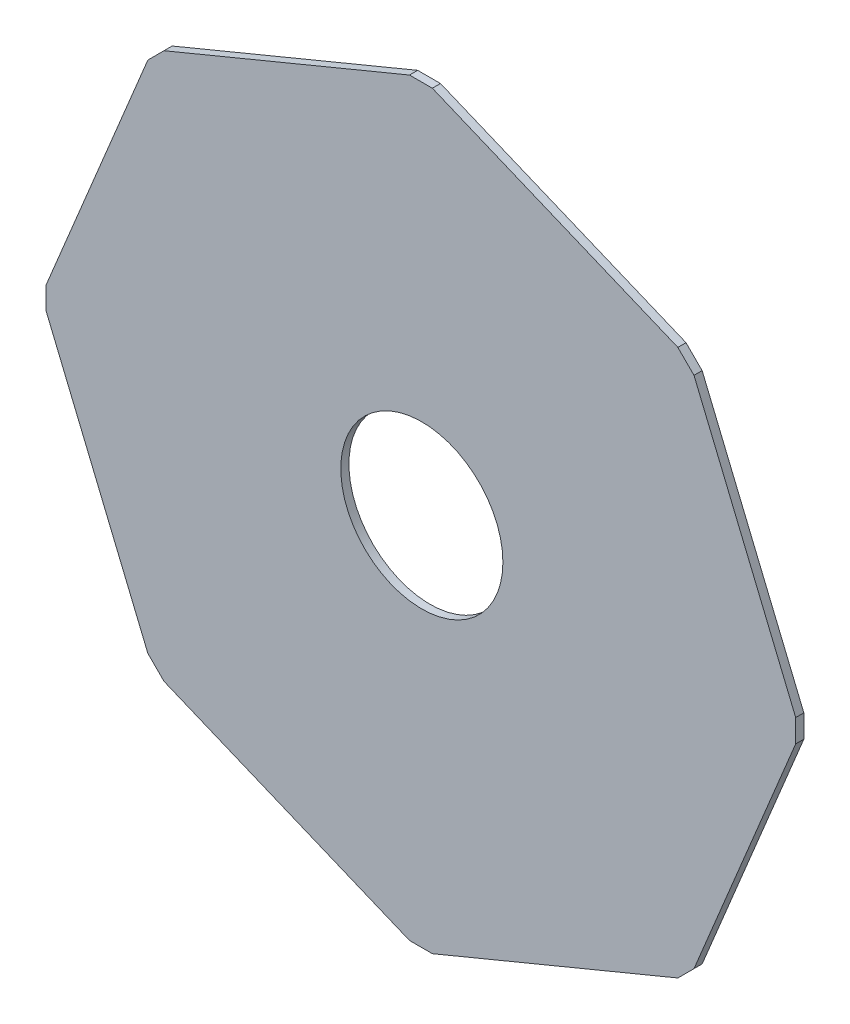
ISO-10303-21;
HEADER;
FILE_DESCRIPTION(('STEP AP214'),'2;1');
FILE_NAME('part.step','',(''),(''),'','','');
FILE_SCHEMA(('AUTOMOTIVE_DESIGN { 1 0 10303 214 1 1 1 1 }'));
ENDSEC;
DATA;
#1=APPLICATION_CONTEXT('core data for automotive mechanical design processes');
#2=APPLICATION_PROTOCOL_DEFINITION('international standard','automotive_design',2000,#1);
#3=PRODUCT_CONTEXT('',#1,'mechanical');
#4=PRODUCT('Part','Part','',(#3));
#5=PRODUCT_RELATED_PRODUCT_CATEGORY('part','',(#4));
#6=PRODUCT_DEFINITION_FORMATION('','',#4);
#7=PRODUCT_DEFINITION_CONTEXT('part definition',#1,'design');
#8=PRODUCT_DEFINITION('design','',#6,#7);
#9=PRODUCT_DEFINITION_SHAPE('','',#8);
#10=(LENGTH_UNIT() NAMED_UNIT(*) SI_UNIT(.MILLI.,.METRE.));
#11=(NAMED_UNIT(*) PLANE_ANGLE_UNIT() SI_UNIT($,.RADIAN.));
#12=(NAMED_UNIT(*) SI_UNIT($,.STERADIAN.) SOLID_ANGLE_UNIT());
#13=UNCERTAINTY_MEASURE_WITH_UNIT(LENGTH_MEASURE(1.E-05),#10,'distance_accuracy_value','');
#14=(GEOMETRIC_REPRESENTATION_CONTEXT(3) GLOBAL_UNCERTAINTY_ASSIGNED_CONTEXT((#13)) GLOBAL_UNIT_ASSIGNED_CONTEXT((#10,
#11,#12)) REPRESENTATION_CONTEXT('',''));
#15=CARTESIAN_POINT('',(0.,0.,0.));
#16=DIRECTION('',(0.,0.,1.));
#17=DIRECTION('',(1.,0.,0.));
#18=AXIS2_PLACEMENT_3D('',#15,#16,#17);
#19=CARTESIAN_POINT('',(0.,0.,5.));
#20=DIRECTION('',(0.,0.,1.));
#21=DIRECTION('',(1.,0.,0.));
#22=AXIS2_PLACEMENT_3D('',#19,#20,#21);
#23=PLANE('',#22);
#24=DIRECTION('',(0.,-1.,0.));
#25=VECTOR('',#24,1.);
#26=CARTESIAN_POINT('',(-230.557942617036,7.27897130849087,5.));
#27=LINE('',#26,#25);
#28=CARTESIAN_POINT('',(-230.557942617036,7.27897130849087,5.));
#29=VERTEX_POINT('',#28);
#30=CARTESIAN_POINT('',(-230.557942617036,-6.7210286914996,5.));
#31=VERTEX_POINT('',#30);
#32=EDGE_CURVE('E211',#29,#31,#27,.T.);
#33=ORIENTED_EDGE('',*,*,#32,.T.);
#34=DIRECTION('',(0.382683432365128,-0.923879532511271,0.));
#35=VECTOR('',#34,1.);
#36=CARTESIAN_POINT('',(-230.557942617036,-6.7210286914996,5.));
#37=LINE('',#36,#35);
#38=CARTESIAN_POINT('',(-168.142249758237,-157.405840896109,5.));
#39=VERTEX_POINT('',#38);
#40=EDGE_CURVE('E119',#31,#39,#37,.T.);
#41=ORIENTED_EDGE('',*,*,#40,.T.);
#42=DIRECTION('',(0.707106781186801,-0.707106781186294,0.));
#43=VECTOR('',#42,1.);
#44=CARTESIAN_POINT('',(-168.142249758237,-157.405840896109,5.));
#45=LINE('',#44,#43);
#46=CARTESIAN_POINT('',(-158.242754821622,-167.305335832717,5.));
#47=VERTEX_POINT('',#46);
#48=EDGE_CURVE('E250',#39,#47,#45,.T.);
#49=ORIENTED_EDGE('',*,*,#48,.T.);
#50=DIRECTION('',(0.923879532511295,-0.382683432365069,0.));
#51=VECTOR('',#50,1.);
#52=CARTESIAN_POINT('',(-158.242754821622,-167.305335832717,5.));
#53=LINE('',#52,#51);
#54=CARTESIAN_POINT('',(-7.55794261702294,-229.721028691501,5.));
#55=VERTEX_POINT('',#54);
#56=EDGE_CURVE('E269',#47,#55,#53,.T.);
#57=ORIENTED_EDGE('',*,*,#56,.T.);
#58=DIRECTION('',(1.,0.,0.));
#59=VECTOR('',#58,1.);
#60=CARTESIAN_POINT('',(-7.55794261702294,-229.721028691501,5.));
#61=LINE('',#60,#59);
#62=CARTESIAN_POINT('',(6.4420573829764,-229.721028691501,5.));
#63=VERTEX_POINT('',#62);
#64=EDGE_CURVE('E266',#55,#63,#61,.T.);
#65=ORIENTED_EDGE('',*,*,#64,.T.);
#66=DIRECTION('',(0.923879532511268,0.382683432365135,0.));
#67=VECTOR('',#66,1.);
#68=CARTESIAN_POINT('',(6.4420573829764,-229.721028691501,5.));
#69=LINE('',#68,#67);
#70=CARTESIAN_POINT('',(157.126869587579,-167.305335832703,5.));
#71=VERTEX_POINT('',#70);
#72=EDGE_CURVE('E268',#63,#71,#69,.T.);
#73=ORIENTED_EDGE('',*,*,#72,.T.);
#74=DIRECTION('',(0.707106781186548,0.707106781186548,0.));
#75=VECTOR('',#74,1.);
#76=CARTESIAN_POINT('',(157.126869587579,-167.305335832703,5.));
#77=LINE('',#76,#75);
#78=CARTESIAN_POINT('',(167.026364524185,-157.405840896097,5.));
#79=VERTEX_POINT('',#78);
#80=EDGE_CURVE('E271',#71,#79,#77,.T.);
#81=ORIENTED_EDGE('',*,*,#80,.T.);
#82=DIRECTION('',(0.382683432365019,0.923879532511316,0.));
#83=VECTOR('',#82,1.);
#84=CARTESIAN_POINT('',(167.026364524185,-157.405840896097,5.));
#85=LINE('',#84,#83);
#86=CARTESIAN_POINT('',(229.442057382966,-6.72102869148158,5.));
#87=VERTEX_POINT('',#86);
#88=EDGE_CURVE('E277',#79,#87,#85,.T.);
#89=ORIENTED_EDGE('',*,*,#88,.T.);
#90=DIRECTION('',(0.,1.,0.));
#91=VECTOR('',#90,1.);
#92=CARTESIAN_POINT('',(229.442057382966,-6.72102869148158,5.));
#93=LINE('',#92,#91);
#94=CARTESIAN_POINT('',(229.442057382966,7.27897130850405,5.));
#95=VERTEX_POINT('',#94);
#96=EDGE_CURVE('E279',#87,#95,#93,.T.);
#97=ORIENTED_EDGE('',*,*,#96,.T.);
#98=DIRECTION('',(-0.38268343236497,0.923879532511336,0.));
#99=VECTOR('',#98,1.);
#100=CARTESIAN_POINT('',(229.442057382966,7.27897130850405,5.));
#101=LINE('',#100,#99);
#102=CARTESIAN_POINT('',(167.026364524201,157.963783513104,5.));
#103=VERTEX_POINT('',#102);
#104=EDGE_CURVE('E281',#95,#103,#101,.T.);
#105=ORIENTED_EDGE('',*,*,#104,.T.);
#106=DIRECTION('',(-0.707106781186548,0.707106781186548,0.));
#107=VECTOR('',#106,1.);
#108=CARTESIAN_POINT('',(167.026364524201,157.963783513104,5.));
#109=LINE('',#108,#107);
#110=CARTESIAN_POINT('',(157.126869587596,167.863278449709,5.));
#111=VERTEX_POINT('',#110);
#112=EDGE_CURVE('E283',#103,#111,#109,.T.);
#113=ORIENTED_EDGE('',*,*,#112,.T.);
#114=DIRECTION('',(-0.923879532511311,0.38268343236503,0.));
#115=VECTOR('',#114,1.);
#116=CARTESIAN_POINT('',(157.126869587596,167.863278449709,5.));
#117=LINE('',#116,#115);
#118=CARTESIAN_POINT('',(6.44205738297554,230.278971308494,5.));
#119=VERTEX_POINT('',#118);
#120=EDGE_CURVE('E285',#111,#119,#117,.T.);
#121=ORIENTED_EDGE('',*,*,#120,.T.);
#122=DIRECTION('',(-1.,0.,0.));
#123=VECTOR('',#122,1.);
#124=CARTESIAN_POINT('',(6.44205738297554,230.278971308494,5.));
#125=LINE('',#124,#123);
#126=CARTESIAN_POINT('',(-7.55794261702026,230.278971308494,5.));
#127=VERTEX_POINT('',#126);
#128=EDGE_CURVE('E162',#119,#127,#125,.T.);
#129=ORIENTED_EDGE('',*,*,#128,.T.);
#130=DIRECTION('',(-0.923879532511271,-0.382683432365128,0.));
#131=VECTOR('',#130,1.);
#132=CARTESIAN_POINT('',(-7.55794261702026,230.278971308494,5.));
#133=LINE('',#132,#131);
#134=CARTESIAN_POINT('',(-158.24275482163,167.863278449695,5.));
#135=VERTEX_POINT('',#134);
#136=EDGE_CURVE('E156',#127,#135,#133,.T.);
#137=ORIENTED_EDGE('',*,*,#136,.T.);
#138=DIRECTION('',(-0.707106781186548,-0.707106781186548,0.));
#139=VECTOR('',#138,1.);
#140=CARTESIAN_POINT('',(-158.24275482163,167.863278449695,5.));
#141=LINE('',#140,#139);
#142=CARTESIAN_POINT('',(-168.142249758279,157.963783513045,5.));
#143=VERTEX_POINT('',#142);
#144=EDGE_CURVE('E160',#135,#143,#141,.T.);
#145=ORIENTED_EDGE('',*,*,#144,.T.);
#146=DIRECTION('',(-0.382683432365024,-0.923879532511314,0.));
#147=VECTOR('',#146,1.);
#148=CARTESIAN_POINT('',(-168.142249758279,157.963783513045,5.));
#149=LINE('',#148,#147);
#150=EDGE_CURVE('E52',#143,#29,#149,.T.);
#151=ORIENTED_EDGE('',*,*,#150,.T.);
#152=EDGE_LOOP('',(#33,#41,#49,#57,#65,#73,#81,#89,#97,#105,#113,#121,#129,#137,#145,#151));
#153=FACE_BOUND('',#152,.T.);
#154=CARTESIAN_POINT('',(0.,0.,5.));
#155=DIRECTION('',(0.,0.,1.));
#156=DIRECTION('',(1.,0.,0.));
#157=AXIS2_PLACEMENT_3D('',#154,#155,#156);
#158=CIRCLE('',#157,49.75);
#159=CARTESIAN_POINT('',(49.75,0.,5.));
#160=VERTEX_POINT('',#159);
#161=EDGE_CURVE('E184',#160,#160,#158,.T.);
#162=ORIENTED_EDGE('',*,*,#161,.F.);
#163=EDGE_LOOP('',(#162));
#164=FACE_BOUND('',#163,.T.);
#165=ADVANCED_FACE('F35',(#153,#164),#23,.T.);
#166=CARTESIAN_POINT('',(0.,0.,0.));
#167=DIRECTION('',(0.,0.,1.));
#168=DIRECTION('',(1.,0.,0.));
#169=AXIS2_PLACEMENT_3D('',#166,#167,#168);
#170=PLANE('',#169);
#171=DIRECTION('',(0.,-1.,0.));
#172=VECTOR('',#171,1.);
#173=CARTESIAN_POINT('',(-230.557942617036,7.27897130849087,0.));
#174=LINE('',#173,#172);
#175=CARTESIAN_POINT('',(-230.557942617036,7.27897130849087,0.));
#176=VERTEX_POINT('',#175);
#177=CARTESIAN_POINT('',(-230.557942617036,-6.7210286914996,0.));
#178=VERTEX_POINT('',#177);
#179=EDGE_CURVE('E180',#176,#178,#174,.T.);
#180=ORIENTED_EDGE('',*,*,#179,.F.);
#181=DIRECTION('',(-0.382683432365024,-0.923879532511314,0.));
#182=VECTOR('',#181,1.);
#183=CARTESIAN_POINT('',(-168.142249758279,157.963783513045,0.));
#184=LINE('',#183,#182);
#185=CARTESIAN_POINT('',(-168.142249758279,157.963783513045,0.));
#186=VERTEX_POINT('',#185);
#187=EDGE_CURVE('E111',#186,#176,#184,.T.);
#188=ORIENTED_EDGE('',*,*,#187,.F.);
#189=DIRECTION('',(-0.707106781186548,-0.707106781186548,0.));
#190=VECTOR('',#189,1.);
#191=CARTESIAN_POINT('',(-158.24275482163,167.863278449695,0.));
#192=LINE('',#191,#190);
#193=CARTESIAN_POINT('',(-158.24275482163,167.863278449695,0.));
#194=VERTEX_POINT('',#193);
#195=EDGE_CURVE('E105',#194,#186,#192,.T.);
#196=ORIENTED_EDGE('',*,*,#195,.F.);
#197=DIRECTION('',(-0.923879532511271,-0.382683432365128,0.));
#198=VECTOR('',#197,1.);
#199=CARTESIAN_POINT('',(-7.55794261702026,230.278971308494,0.));
#200=LINE('',#199,#198);
#201=CARTESIAN_POINT('',(-7.55794261702026,230.278971308494,0.));
#202=VERTEX_POINT('',#201);
#203=EDGE_CURVE('E170',#202,#194,#200,.T.);
#204=ORIENTED_EDGE('',*,*,#203,.F.);
#205=DIRECTION('',(-1.,0.,0.));
#206=VECTOR('',#205,1.);
#207=CARTESIAN_POINT('',(6.44205738297554,230.278971308494,0.));
#208=LINE('',#207,#206);
#209=CARTESIAN_POINT('',(6.44205738297554,230.278971308494,0.));
#210=VERTEX_POINT('',#209);
#211=EDGE_CURVE('E206',#210,#202,#208,.T.);
#212=ORIENTED_EDGE('',*,*,#211,.F.);
#213=DIRECTION('',(-0.923879532511311,0.38268343236503,0.));
#214=VECTOR('',#213,1.);
#215=CARTESIAN_POINT('',(157.126869587596,167.863278449709,0.));
#216=LINE('',#215,#214);
#217=CARTESIAN_POINT('',(157.126869587596,167.863278449709,0.));
#218=VERTEX_POINT('',#217);
#219=EDGE_CURVE('E204',#218,#210,#216,.T.);
#220=ORIENTED_EDGE('',*,*,#219,.F.);
#221=DIRECTION('',(-0.707106781186548,0.707106781186548,0.));
#222=VECTOR('',#221,1.);
#223=CARTESIAN_POINT('',(167.026364524201,157.963783513104,0.));
#224=LINE('',#223,#222);
#225=CARTESIAN_POINT('',(167.026364524201,157.963783513104,0.));
#226=VERTEX_POINT('',#225);
#227=EDGE_CURVE('E202',#226,#218,#224,.T.);
#228=ORIENTED_EDGE('',*,*,#227,.F.);
#229=DIRECTION('',(-0.38268343236497,0.923879532511336,0.));
#230=VECTOR('',#229,1.);
#231=CARTESIAN_POINT('',(229.442057382966,7.27897130850405,0.));
#232=LINE('',#231,#230);
#233=CARTESIAN_POINT('',(229.442057382966,7.27897130850405,0.));
#234=VERTEX_POINT('',#233);
#235=EDGE_CURVE('E200',#234,#226,#232,.T.);
#236=ORIENTED_EDGE('',*,*,#235,.F.);
#237=DIRECTION('',(0.,1.,0.));
#238=VECTOR('',#237,1.);
#239=CARTESIAN_POINT('',(229.442057382966,-6.72102869148158,0.));
#240=LINE('',#239,#238);
#241=CARTESIAN_POINT('',(229.442057382966,-6.72102869148158,0.));
#242=VERTEX_POINT('',#241);
#243=EDGE_CURVE('E198',#242,#234,#240,.T.);
#244=ORIENTED_EDGE('',*,*,#243,.F.);
#245=DIRECTION('',(0.382683432365019,0.923879532511316,0.));
#246=VECTOR('',#245,1.);
#247=CARTESIAN_POINT('',(167.026364524185,-157.405840896097,0.));
#248=LINE('',#247,#246);
#249=CARTESIAN_POINT('',(167.026364524185,-157.405840896097,0.));
#250=VERTEX_POINT('',#249);
#251=EDGE_CURVE('E196',#250,#242,#248,.T.);
#252=ORIENTED_EDGE('',*,*,#251,.F.);
#253=DIRECTION('',(0.707106781186548,0.707106781186548,0.));
#254=VECTOR('',#253,1.);
#255=CARTESIAN_POINT('',(157.126869587579,-167.305335832703,0.));
#256=LINE('',#255,#254);
#257=CARTESIAN_POINT('',(157.126869587579,-167.305335832703,0.));
#258=VERTEX_POINT('',#257);
#259=EDGE_CURVE('E194',#258,#250,#256,.T.);
#260=ORIENTED_EDGE('',*,*,#259,.F.);
#261=DIRECTION('',(0.923879532511268,0.382683432365135,0.));
#262=VECTOR('',#261,1.);
#263=CARTESIAN_POINT('',(6.4420573829764,-229.721028691501,0.));
#264=LINE('',#263,#262);
#265=CARTESIAN_POINT('',(6.4420573829764,-229.721028691501,0.));
#266=VERTEX_POINT('',#265);
#267=EDGE_CURVE('E192',#266,#258,#264,.T.);
#268=ORIENTED_EDGE('',*,*,#267,.F.);
#269=DIRECTION('',(1.,0.,0.));
#270=VECTOR('',#269,1.);
#271=CARTESIAN_POINT('',(-7.55794261702294,-229.721028691501,0.));
#272=LINE('',#271,#270);
#273=CARTESIAN_POINT('',(-7.55794261702294,-229.721028691501,0.));
#274=VERTEX_POINT('',#273);
#275=EDGE_CURVE('E190',#274,#266,#272,.T.);
#276=ORIENTED_EDGE('',*,*,#275,.F.);
#277=DIRECTION('',(0.923879532511295,-0.382683432365069,0.));
#278=VECTOR('',#277,1.);
#279=CARTESIAN_POINT('',(-158.242754821622,-167.305335832717,0.));
#280=LINE('',#279,#278);
#281=CARTESIAN_POINT('',(-158.242754821622,-167.305335832717,0.));
#282=VERTEX_POINT('',#281);
#283=EDGE_CURVE('E188',#282,#274,#280,.T.);
#284=ORIENTED_EDGE('',*,*,#283,.F.);
#285=DIRECTION('',(0.707106781186801,-0.707106781186294,0.));
#286=VECTOR('',#285,1.);
#287=CARTESIAN_POINT('',(-168.142249758237,-157.405840896109,0.));
#288=LINE('',#287,#286);
#289=CARTESIAN_POINT('',(-168.142249758237,-157.405840896109,0.));
#290=VERTEX_POINT('',#289);
#291=EDGE_CURVE('E186',#290,#282,#288,.T.);
#292=ORIENTED_EDGE('',*,*,#291,.F.);
#293=DIRECTION('',(0.382683432365128,-0.923879532511271,0.));
#294=VECTOR('',#293,1.);
#295=CARTESIAN_POINT('',(-230.557942617036,-6.7210286914996,0.));
#296=LINE('',#295,#294);
#297=EDGE_CURVE('E183',#178,#290,#296,.T.);
#298=ORIENTED_EDGE('',*,*,#297,.F.);
#299=EDGE_LOOP('',(#180,#188,#196,#204,#212,#220,#228,#236,#244,#252,#260,#268,#276,#284,#292,#298));
#300=FACE_BOUND('',#299,.T.);
#301=CARTESIAN_POINT('',(0.,0.,0.));
#302=DIRECTION('',(0.,0.,1.));
#303=DIRECTION('',(1.,0.,0.));
#304=AXIS2_PLACEMENT_3D('',#301,#302,#303);
#305=CIRCLE('',#304,49.75);
#306=CARTESIAN_POINT('',(49.75,0.,0.));
#307=VERTEX_POINT('',#306);
#308=EDGE_CURVE('E484',#307,#307,#305,.T.);
#309=ORIENTED_EDGE('',*,*,#308,.T.);
#310=EDGE_LOOP('',(#309));
#311=FACE_BOUND('',#310,.T.);
#312=ADVANCED_FACE('F254',(#300,#311),#170,.F.);
#313=CARTESIAN_POINT('',(-230.557942617036,7.27897130849087,5.));
#314=DIRECTION('',(1.,0.,0.));
#315=DIRECTION('',(0.,0.,-1.));
#316=AXIS2_PLACEMENT_3D('',#313,#314,#315);
#317=PLANE('',#316);
#318=ORIENTED_EDGE('',*,*,#179,.T.);
#319=DIRECTION('',(0.,0.,-1.));
#320=VECTOR('',#319,1.);
#321=CARTESIAN_POINT('',(-230.557942617036,-6.7210286914996,5.));
#322=LINE('',#321,#320);
#323=EDGE_CURVE('E11',#31,#178,#322,.T.);
#324=ORIENTED_EDGE('',*,*,#323,.F.);
#325=ORIENTED_EDGE('',*,*,#32,.F.);
#326=DIRECTION('',(0.,0.,-1.));
#327=VECTOR('',#326,1.);
#328=CARTESIAN_POINT('',(-230.557942617036,7.27897130849087,5.));
#329=LINE('',#328,#327);
#330=EDGE_CURVE('E176',#29,#176,#329,.T.);
#331=ORIENTED_EDGE('',*,*,#330,.T.);
#332=EDGE_LOOP('',(#318,#324,#325,#331));
#333=FACE_BOUND('',#332,.T.);
#334=ADVANCED_FACE('F37',(#333),#317,.F.);
#335=CARTESIAN_POINT('',(-230.557942617036,-6.7210286914996,5.));
#336=DIRECTION('',(0.923879532511271,0.382683432365128,0.));
#337=DIRECTION('',(-0.382683432365128,0.923879532511271,0.));
#338=AXIS2_PLACEMENT_3D('',#335,#336,#337);
#339=PLANE('',#338);
#340=ORIENTED_EDGE('',*,*,#297,.T.);
#341=DIRECTION('',(0.,0.,-1.));
#342=VECTOR('',#341,1.);
#343=CARTESIAN_POINT('',(-168.142249758237,-157.405840896109,5.));
#344=LINE('',#343,#342);
#345=EDGE_CURVE('E44',#39,#290,#344,.T.);
#346=ORIENTED_EDGE('',*,*,#345,.F.);
#347=ORIENTED_EDGE('',*,*,#40,.F.);
#348=ORIENTED_EDGE('',*,*,#323,.T.);
#349=EDGE_LOOP('',(#340,#346,#347,#348));
#350=FACE_BOUND('',#349,.T.);
#351=ADVANCED_FACE('F319',(#350),#339,.F.);
#352=CARTESIAN_POINT('',(-168.142249758237,-157.405840896109,5.));
#353=DIRECTION('',(0.707106781186294,0.707106781186801,0.));
#354=DIRECTION('',(-0.707106781186801,0.707106781186294,0.));
#355=AXIS2_PLACEMENT_3D('',#352,#353,#354);
#356=PLANE('',#355);
#357=ORIENTED_EDGE('',*,*,#291,.T.);
#358=DIRECTION('',(0.,0.,-1.));
#359=VECTOR('',#358,1.);
#360=CARTESIAN_POINT('',(-158.242754821622,-167.305335832717,5.));
#361=LINE('',#360,#359);
#362=EDGE_CURVE('E242',#47,#282,#361,.T.);
#363=ORIENTED_EDGE('',*,*,#362,.F.);
#364=ORIENTED_EDGE('',*,*,#48,.F.);
#365=ORIENTED_EDGE('',*,*,#345,.T.);
#366=EDGE_LOOP('',(#357,#363,#364,#365));
#367=FACE_BOUND('',#366,.T.);
#368=ADVANCED_FACE('F248',(#367),#356,.F.);
#369=CARTESIAN_POINT('',(-158.242754821622,-167.305335832717,5.));
#370=DIRECTION('',(0.382683432365069,0.923879532511296,0.));
#371=DIRECTION('',(-0.923879532511296,0.382683432365069,0.));
#372=AXIS2_PLACEMENT_3D('',#369,#370,#371);
#373=PLANE('',#372);
#374=ORIENTED_EDGE('',*,*,#283,.T.);
#375=DIRECTION('',(0.,0.,-1.));
#376=VECTOR('',#375,1.);
#377=CARTESIAN_POINT('',(-7.55794261702294,-229.721028691501,5.));
#378=LINE('',#377,#376);
#379=EDGE_CURVE('E239',#55,#274,#378,.T.);
#380=ORIENTED_EDGE('',*,*,#379,.F.);
#381=ORIENTED_EDGE('',*,*,#56,.F.);
#382=ORIENTED_EDGE('',*,*,#362,.T.);
#383=EDGE_LOOP('',(#374,#380,#381,#382));
#384=FACE_BOUND('',#383,.T.);
#385=ADVANCED_FACE('F260',(#384),#373,.F.);
#386=CARTESIAN_POINT('',(-7.55794261702294,-229.721028691501,5.));
#387=DIRECTION('',(0.,1.,0.));
#388=DIRECTION('',(0.,0.,1.));
#389=AXIS2_PLACEMENT_3D('',#386,#387,#388);
#390=PLANE('',#389);
#391=ORIENTED_EDGE('',*,*,#275,.T.);
#392=DIRECTION('',(0.,0.,-1.));
#393=VECTOR('',#392,1.);
#394=CARTESIAN_POINT('',(6.4420573829764,-229.721028691501,5.));
#395=LINE('',#394,#393);
#396=EDGE_CURVE('E236',#63,#266,#395,.T.);
#397=ORIENTED_EDGE('',*,*,#396,.F.);
#398=ORIENTED_EDGE('',*,*,#64,.F.);
#399=ORIENTED_EDGE('',*,*,#379,.T.);
#400=EDGE_LOOP('',(#391,#397,#398,#399));
#401=FACE_BOUND('',#400,.T.);
#402=ADVANCED_FACE('F264',(#401),#390,.F.);
#403=CARTESIAN_POINT('',(6.4420573829764,-229.721028691501,5.));
#404=DIRECTION('',(-0.382683432365135,0.923879532511268,0.));
#405=DIRECTION('',(-0.923879532511268,-0.382683432365135,0.));
#406=AXIS2_PLACEMENT_3D('',#403,#404,#405);
#407=PLANE('',#406);
#408=ORIENTED_EDGE('',*,*,#267,.T.);
#409=DIRECTION('',(0.,0.,-1.));
#410=VECTOR('',#409,1.);
#411=CARTESIAN_POINT('',(157.126869587579,-167.305335832703,5.));
#412=LINE('',#411,#410);
#413=EDGE_CURVE('E233',#71,#258,#412,.T.);
#414=ORIENTED_EDGE('',*,*,#413,.F.);
#415=ORIENTED_EDGE('',*,*,#72,.F.);
#416=ORIENTED_EDGE('',*,*,#396,.T.);
#417=EDGE_LOOP('',(#408,#414,#415,#416));
#418=FACE_BOUND('',#417,.T.);
#419=ADVANCED_FACE('F332',(#418),#407,.F.);
#420=CARTESIAN_POINT('',(157.126869587579,-167.305335832703,5.));
#421=DIRECTION('',(-0.707106781186548,0.707106781186548,0.));
#422=DIRECTION('',(-0.707106781186548,-0.707106781186548,0.));
#423=AXIS2_PLACEMENT_3D('',#420,#421,#422);
#424=PLANE('',#423);
#425=ORIENTED_EDGE('',*,*,#259,.T.);
#426=DIRECTION('',(0.,0.,-1.));
#427=VECTOR('',#426,1.);
#428=CARTESIAN_POINT('',(167.026364524185,-157.405840896097,5.));
#429=LINE('',#428,#427);
#430=EDGE_CURVE('E230',#79,#250,#429,.T.);
#431=ORIENTED_EDGE('',*,*,#430,.F.);
#432=ORIENTED_EDGE('',*,*,#80,.F.);
#433=ORIENTED_EDGE('',*,*,#413,.T.);
#434=EDGE_LOOP('',(#425,#431,#432,#433));
#435=FACE_BOUND('',#434,.T.);
#436=ADVANCED_FACE('F335',(#435),#424,.F.);
#437=CARTESIAN_POINT('',(167.026364524185,-157.405840896097,5.));
#438=DIRECTION('',(-0.923879532511316,0.382683432365019,0.));
#439=DIRECTION('',(-0.382683432365019,-0.923879532511316,0.));
#440=AXIS2_PLACEMENT_3D('',#437,#438,#439);
#441=PLANE('',#440);
#442=ORIENTED_EDGE('',*,*,#251,.T.);
#443=DIRECTION('',(0.,0.,-1.));
#444=VECTOR('',#443,1.);
#445=CARTESIAN_POINT('',(229.442057382966,-6.72102869148158,5.));
#446=LINE('',#445,#444);
#447=EDGE_CURVE('E227',#87,#242,#446,.T.);
#448=ORIENTED_EDGE('',*,*,#447,.F.);
#449=ORIENTED_EDGE('',*,*,#88,.F.);
#450=ORIENTED_EDGE('',*,*,#430,.T.);
#451=EDGE_LOOP('',(#442,#448,#449,#450));
#452=FACE_BOUND('',#451,.T.);
#453=ADVANCED_FACE('F339',(#452),#441,.F.);
#454=CARTESIAN_POINT('',(229.442057382966,-6.72102869148158,5.));
#455=DIRECTION('',(-1.,0.,0.));
#456=DIRECTION('',(0.,0.,1.));
#457=AXIS2_PLACEMENT_3D('',#454,#455,#456);
#458=PLANE('',#457);
#459=ORIENTED_EDGE('',*,*,#243,.T.);
#460=DIRECTION('',(0.,0.,-1.));
#461=VECTOR('',#460,1.);
#462=CARTESIAN_POINT('',(229.442057382966,7.27897130850405,5.));
#463=LINE('',#462,#461);
#464=EDGE_CURVE('E224',#95,#234,#463,.T.);
#465=ORIENTED_EDGE('',*,*,#464,.F.);
#466=ORIENTED_EDGE('',*,*,#96,.F.);
#467=ORIENTED_EDGE('',*,*,#447,.T.);
#468=EDGE_LOOP('',(#459,#465,#466,#467));
#469=FACE_BOUND('',#468,.T.);
#470=ADVANCED_FACE('F343',(#469),#458,.F.);
#471=CARTESIAN_POINT('',(229.442057382966,7.27897130850405,5.));
#472=DIRECTION('',(-0.923879532511336,-0.38268343236497,0.));
#473=DIRECTION('',(0.38268343236497,-0.923879532511336,0.));
#474=AXIS2_PLACEMENT_3D('',#471,#472,#473);
#475=PLANE('',#474);
#476=ORIENTED_EDGE('',*,*,#235,.T.);
#477=DIRECTION('',(0.,0.,-1.));
#478=VECTOR('',#477,1.);
#479=CARTESIAN_POINT('',(167.026364524201,157.963783513104,5.));
#480=LINE('',#479,#478);
#481=EDGE_CURVE('E221',#103,#226,#480,.T.);
#482=ORIENTED_EDGE('',*,*,#481,.F.);
#483=ORIENTED_EDGE('',*,*,#104,.F.);
#484=ORIENTED_EDGE('',*,*,#464,.T.);
#485=EDGE_LOOP('',(#476,#482,#483,#484));
#486=FACE_BOUND('',#485,.T.);
#487=ADVANCED_FACE('F347',(#486),#475,.F.);
#488=CARTESIAN_POINT('',(167.026364524201,157.963783513104,5.));
#489=DIRECTION('',(-0.707106781186548,-0.707106781186548,0.));
#490=DIRECTION('',(0.707106781186548,-0.707106781186548,0.));
#491=AXIS2_PLACEMENT_3D('',#488,#489,#490);
#492=PLANE('',#491);
#493=ORIENTED_EDGE('',*,*,#227,.T.);
#494=DIRECTION('',(0.,0.,-1.));
#495=VECTOR('',#494,1.);
#496=CARTESIAN_POINT('',(157.126869587596,167.863278449709,5.));
#497=LINE('',#496,#495);
#498=EDGE_CURVE('E218',#111,#218,#497,.T.);
#499=ORIENTED_EDGE('',*,*,#498,.F.);
#500=ORIENTED_EDGE('',*,*,#112,.F.);
#501=ORIENTED_EDGE('',*,*,#481,.T.);
#502=EDGE_LOOP('',(#493,#499,#500,#501));
#503=FACE_BOUND('',#502,.T.);
#504=ADVANCED_FACE('F351',(#503),#492,.F.);
#505=CARTESIAN_POINT('',(157.126869587596,167.863278449709,5.));
#506=DIRECTION('',(-0.38268343236503,-0.923879532511311,0.));
#507=DIRECTION('',(0.923879532511311,-0.38268343236503,0.));
#508=AXIS2_PLACEMENT_3D('',#505,#506,#507);
#509=PLANE('',#508);
#510=ORIENTED_EDGE('',*,*,#219,.T.);
#511=DIRECTION('',(0.,0.,-1.));
#512=VECTOR('',#511,1.);
#513=CARTESIAN_POINT('',(6.44205738297554,230.278971308494,5.));
#514=LINE('',#513,#512);
#515=EDGE_CURVE('E215',#119,#210,#514,.T.);
#516=ORIENTED_EDGE('',*,*,#515,.F.);
#517=ORIENTED_EDGE('',*,*,#120,.F.);
#518=ORIENTED_EDGE('',*,*,#498,.T.);
#519=EDGE_LOOP('',(#510,#516,#517,#518));
#520=FACE_BOUND('',#519,.T.);
#521=ADVANCED_FACE('F291',(#520),#509,.F.);
#522=CARTESIAN_POINT('',(6.44205738297554,230.278971308494,5.));
#523=DIRECTION('',(0.,-1.,0.));
#524=DIRECTION('',(0.,0.,-1.));
#525=AXIS2_PLACEMENT_3D('',#522,#523,#524);
#526=PLANE('',#525);
#527=ORIENTED_EDGE('',*,*,#211,.T.);
#528=DIRECTION('',(0.,0.,-1.));
#529=VECTOR('',#528,1.);
#530=CARTESIAN_POINT('',(-7.55794261702026,230.278971308494,5.));
#531=LINE('',#530,#529);
#532=EDGE_CURVE('E171',#127,#202,#531,.T.);
#533=ORIENTED_EDGE('',*,*,#532,.F.);
#534=ORIENTED_EDGE('',*,*,#128,.F.);
#535=ORIENTED_EDGE('',*,*,#515,.T.);
#536=EDGE_LOOP('',(#527,#533,#534,#535));
#537=FACE_BOUND('',#536,.T.);
#538=ADVANCED_FACE('F295',(#537),#526,.F.);
#539=CARTESIAN_POINT('',(-7.55794261702026,230.278971308494,5.));
#540=DIRECTION('',(0.382683432365128,-0.923879532511271,0.));
#541=DIRECTION('',(0.923879532511271,0.382683432365128,0.));
#542=AXIS2_PLACEMENT_3D('',#539,#540,#541);
#543=PLANE('',#542);
#544=ORIENTED_EDGE('',*,*,#203,.T.);
#545=DIRECTION('',(0.,0.,-1.));
#546=VECTOR('',#545,1.);
#547=CARTESIAN_POINT('',(-158.24275482163,167.863278449695,5.));
#548=LINE('',#547,#546);
#549=EDGE_CURVE('E167',#135,#194,#548,.T.);
#550=ORIENTED_EDGE('',*,*,#549,.F.);
#551=ORIENTED_EDGE('',*,*,#136,.F.);
#552=ORIENTED_EDGE('',*,*,#532,.T.);
#553=EDGE_LOOP('',(#544,#550,#551,#552));
#554=FACE_BOUND('',#553,.T.);
#555=ADVANCED_FACE('F168',(#554),#543,.F.);
#556=CARTESIAN_POINT('',(-158.24275482163,167.863278449695,5.));
#557=DIRECTION('',(0.707106781186548,-0.707106781186548,0.));
#558=DIRECTION('',(0.707106781186548,0.707106781186548,0.));
#559=AXIS2_PLACEMENT_3D('',#556,#557,#558);
#560=PLANE('',#559);
#561=ORIENTED_EDGE('',*,*,#195,.T.);
#562=DIRECTION('',(0.,0.,-1.));
#563=VECTOR('',#562,1.);
#564=CARTESIAN_POINT('',(-168.142249758279,157.963783513045,5.));
#565=LINE('',#564,#563);
#566=EDGE_CURVE('E172',#143,#186,#565,.T.);
#567=ORIENTED_EDGE('',*,*,#566,.F.);
#568=ORIENTED_EDGE('',*,*,#144,.F.);
#569=ORIENTED_EDGE('',*,*,#549,.T.);
#570=EDGE_LOOP('',(#561,#567,#568,#569));
#571=FACE_BOUND('',#570,.T.);
#572=ADVANCED_FACE('F174',(#571),#560,.F.);
#573=CARTESIAN_POINT('',(-168.142249758279,157.963783513045,5.));
#574=DIRECTION('',(0.923879532511314,-0.382683432365024,0.));
#575=DIRECTION('',(0.382683432365024,0.923879532511314,0.));
#576=AXIS2_PLACEMENT_3D('',#573,#574,#575);
#577=PLANE('',#576);
#578=ORIENTED_EDGE('',*,*,#187,.T.);
#579=ORIENTED_EDGE('',*,*,#330,.F.);
#580=ORIENTED_EDGE('',*,*,#150,.F.);
#581=ORIENTED_EDGE('',*,*,#566,.T.);
#582=EDGE_LOOP('',(#578,#579,#580,#581));
#583=FACE_BOUND('',#582,.T.);
#584=ADVANCED_FACE('F299',(#583),#577,.F.);
#585=CARTESIAN_POINT('',(0.,0.,5.));
#586=DIRECTION('',(0.,0.,-1.));
#587=DIRECTION('',(-1.,0.,0.));
#588=AXIS2_PLACEMENT_3D('',#585,#586,#587);
#589=CYLINDRICAL_SURFACE('',#588,49.75);
#590=ORIENTED_EDGE('',*,*,#161,.T.);
#591=EDGE_LOOP('',(#590));
#592=FACE_BOUND('',#591,.T.);
#593=ORIENTED_EDGE('',*,*,#308,.F.);
#594=EDGE_LOOP('',(#593));
#595=FACE_BOUND('',#594,.T.);
#596=ADVANCED_FACE('F301',(#592,#595),#589,.F.);
#597=CLOSED_SHELL('',(#165,#312,#334,#351,#368,#385,#402,#419,#436,#453,#470,#487,#504,#521,
#538,#555,#572,#584,#596));
#598=MANIFOLD_SOLID_BREP('B2',#597);
#599=ADVANCED_BREP_SHAPE_REPRESENTATION('',(#18,#598),#14);
#600=SHAPE_DEFINITION_REPRESENTATION(#9,#599);
ENDSEC;
END-ISO-10303-21;
